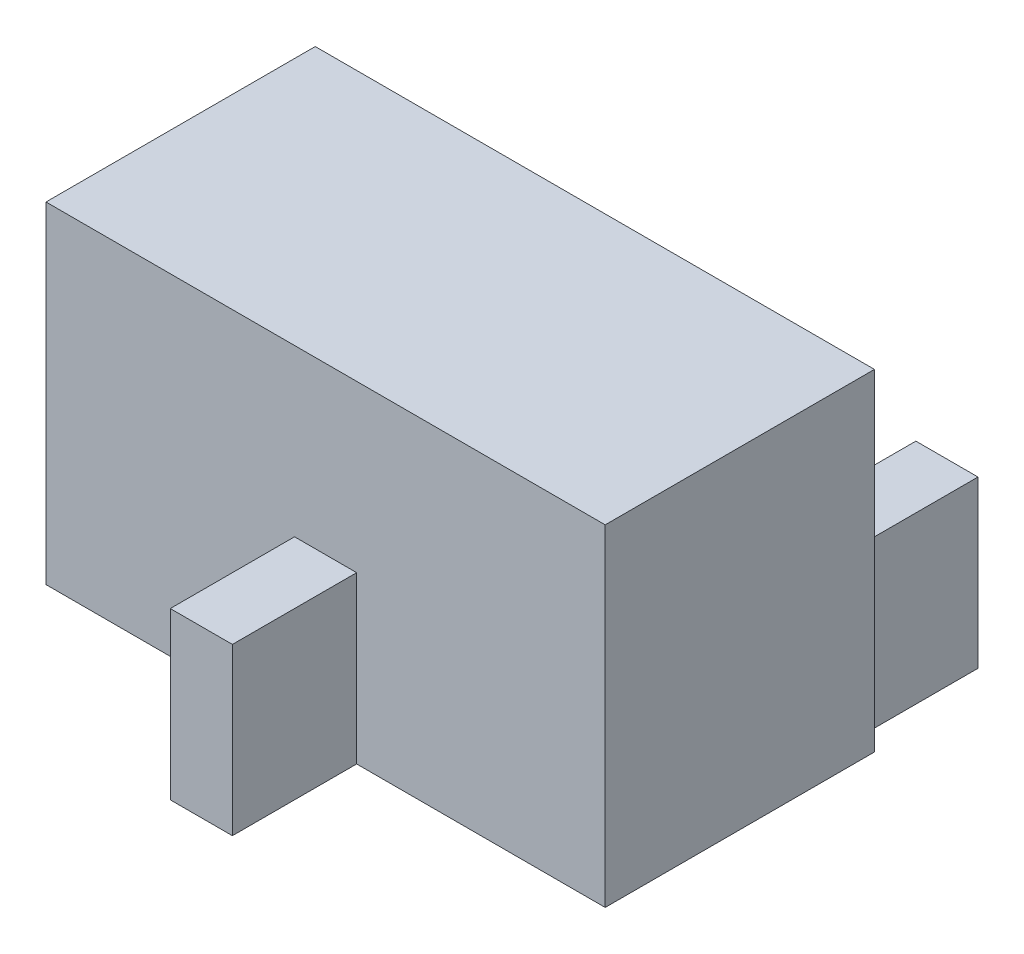
ISO-10303-21;
HEADER;
FILE_DESCRIPTION(('STEP AP214'),'2;1');
FILE_NAME('part.step','',(''),(''),'','','');
FILE_SCHEMA(('AUTOMOTIVE_DESIGN { 1 0 10303 214 1 1 1 1 }'));
ENDSEC;
DATA;
#1=APPLICATION_CONTEXT('core data for automotive mechanical design processes');
#2=APPLICATION_PROTOCOL_DEFINITION('international standard','automotive_design',2000,#1);
#3=PRODUCT_CONTEXT('',#1,'mechanical');
#4=PRODUCT('Part','Part','',(#3));
#5=PRODUCT_RELATED_PRODUCT_CATEGORY('part','',(#4));
#6=PRODUCT_DEFINITION_FORMATION('','',#4);
#7=PRODUCT_DEFINITION_CONTEXT('part definition',#1,'design');
#8=PRODUCT_DEFINITION('design','',#6,#7);
#9=PRODUCT_DEFINITION_SHAPE('','',#8);
#10=(LENGTH_UNIT() NAMED_UNIT(*) SI_UNIT(.MILLI.,.METRE.));
#11=(NAMED_UNIT(*) PLANE_ANGLE_UNIT() SI_UNIT($,.RADIAN.));
#12=(NAMED_UNIT(*) SI_UNIT($,.STERADIAN.) SOLID_ANGLE_UNIT());
#13=UNCERTAINTY_MEASURE_WITH_UNIT(LENGTH_MEASURE(1.E-05),#10,'distance_accuracy_value','');
#14=(GEOMETRIC_REPRESENTATION_CONTEXT(3) GLOBAL_UNCERTAINTY_ASSIGNED_CONTEXT((#13)) GLOBAL_UNIT_ASSIGNED_CONTEXT((#10,
#11,#12)) REPRESENTATION_CONTEXT('',''));
#15=CARTESIAN_POINT('',(0.,0.,0.));
#16=DIRECTION('',(0.,0.,1.));
#17=DIRECTION('',(1.,0.,0.));
#18=AXIS2_PLACEMENT_3D('',#15,#16,#17);
#19=CARTESIAN_POINT('',(-1.81283783783784,1.6,0.816891891891892));
#20=DIRECTION('',(0.,0.,-1.));
#21=DIRECTION('',(-1.,0.,0.));
#22=AXIS2_PLACEMENT_3D('',#19,#20,#21);
#23=PLANE('',#22);
#24=DIRECTION('',(0.,-1.,0.));
#25=VECTOR('',#24,1.);
#26=CARTESIAN_POINT('',(-0.612837837837838,0.8,0.816891891891892));
#27=LINE('',#26,#25);
#28=CARTESIAN_POINT('',(-0.612837837837838,0.8,0.816891891891892));
#29=VERTEX_POINT('',#28);
#30=CARTESIAN_POINT('',(-0.612837837837838,0.,0.816891891891892));
#31=VERTEX_POINT('',#30);
#32=EDGE_CURVE('E314',#29,#31,#27,.T.);
#33=ORIENTED_EDGE('',*,*,#32,.F.);
#34=DIRECTION('',(-1.,0.,0.));
#35=VECTOR('',#34,1.);
#36=CARTESIAN_POINT('',(-0.312837837837838,0.8,0.816891891891892));
#37=LINE('',#36,#35);
#38=CARTESIAN_POINT('',(-0.312837837837838,0.8,0.816891891891892));
#39=VERTEX_POINT('',#38);
#40=EDGE_CURVE('E168',#39,#29,#37,.T.);
#41=ORIENTED_EDGE('',*,*,#40,.F.);
#42=DIRECTION('',(0.,-1.,0.));
#43=VECTOR('',#42,1.);
#44=CARTESIAN_POINT('',(-0.312837837837838,0.8,0.816891891891892));
#45=LINE('',#44,#43);
#46=CARTESIAN_POINT('',(-0.312837837837838,0.,0.816891891891892));
#47=VERTEX_POINT('',#46);
#48=EDGE_CURVE('E180',#39,#47,#45,.T.);
#49=ORIENTED_EDGE('',*,*,#48,.T.);
#50=DIRECTION('',(1.,0.,0.));
#51=VECTOR('',#50,1.);
#52=CARTESIAN_POINT('',(-1.81283783783784,0.,0.816891891891892));
#53=LINE('',#52,#51);
#54=CARTESIAN_POINT('',(0.887162162162162,0.,0.816891891891892));
#55=VERTEX_POINT('',#54);
#56=EDGE_CURVE('E247',#47,#55,#53,.T.);
#57=ORIENTED_EDGE('',*,*,#56,.T.);
#58=DIRECTION('',(0.,-1.,0.));
#59=VECTOR('',#58,1.);
#60=CARTESIAN_POINT('',(0.887162162162162,1.6,0.816891891891892));
#61=LINE('',#60,#59);
#62=CARTESIAN_POINT('',(0.887162162162162,1.6,0.816891891891892));
#63=VERTEX_POINT('',#62);
#64=EDGE_CURVE('E45',#63,#55,#61,.T.);
#65=ORIENTED_EDGE('',*,*,#64,.F.);
#66=DIRECTION('',(1.,0.,0.));
#67=VECTOR('',#66,1.);
#68=CARTESIAN_POINT('',(-1.81283783783784,1.6,0.816891891891892));
#69=LINE('',#68,#67);
#70=CARTESIAN_POINT('',(-1.81283783783784,1.6,0.816891891891892));
#71=VERTEX_POINT('',#70);
#72=EDGE_CURVE('E237',#71,#63,#69,.T.);
#73=ORIENTED_EDGE('',*,*,#72,.F.);
#74=DIRECTION('',(0.,-1.,0.));
#75=VECTOR('',#74,1.);
#76=CARTESIAN_POINT('',(-1.81283783783784,1.6,0.816891891891892));
#77=LINE('',#76,#75);
#78=CARTESIAN_POINT('',(-1.81283783783784,0.,0.816891891891892));
#79=VERTEX_POINT('',#78);
#80=EDGE_CURVE('E11',#71,#79,#77,.T.);
#81=ORIENTED_EDGE('',*,*,#80,.T.);
#82=EDGE_CURVE('E248',#79,#31,#53,.T.);
#83=ORIENTED_EDGE('',*,*,#82,.T.);
#84=EDGE_LOOP('',(#33,#41,#49,#57,#65,#73,#81,#83));
#85=FACE_BOUND('',#84,.T.);
#86=ADVANCED_FACE('F37',(#85),#23,.F.);
#87=CARTESIAN_POINT('',(-1.81283783783784,1.6,-0.483108108108108));
#88=DIRECTION('',(0.,0.,1.));
#89=DIRECTION('',(1.,0.,0.));
#90=AXIS2_PLACEMENT_3D('',#87,#88,#89);
#91=PLANE('',#90);
#92=DIRECTION('',(0.,-1.,0.));
#93=VECTOR('',#92,1.);
#94=CARTESIAN_POINT('',(0.787162162162162,0.8,-0.483108108108108));
#95=LINE('',#94,#93);
#96=CARTESIAN_POINT('',(0.787162162162162,0.8,-0.483108108108108));
#97=VERTEX_POINT('',#96);
#98=CARTESIAN_POINT('',(0.787162162162161,0.,-0.483108108108108));
#99=VERTEX_POINT('',#98);
#100=EDGE_CURVE('E192',#97,#99,#95,.T.);
#101=ORIENTED_EDGE('',*,*,#100,.F.);
#102=DIRECTION('',(1.,0.,0.));
#103=VECTOR('',#102,1.);
#104=CARTESIAN_POINT('',(0.787162162162162,0.8,-0.483108108108108));
#105=LINE('',#104,#103);
#106=CARTESIAN_POINT('',(0.487162162162162,0.8,-0.483108108108108));
#107=VERTEX_POINT('',#106);
#108=EDGE_CURVE('E60',#107,#97,#105,.T.);
#109=ORIENTED_EDGE('',*,*,#108,.F.);
#110=DIRECTION('',(0.,-1.,0.));
#111=VECTOR('',#110,1.);
#112=CARTESIAN_POINT('',(0.487162162162162,0.8,-0.483108108108108));
#113=LINE('',#112,#111);
#114=CARTESIAN_POINT('',(0.487162162162162,0.,-0.483108108108108));
#115=VERTEX_POINT('',#114);
#116=EDGE_CURVE('E199',#107,#115,#113,.T.);
#117=ORIENTED_EDGE('',*,*,#116,.T.);
#118=DIRECTION('',(-1.,0.,0.));
#119=VECTOR('',#118,1.);
#120=CARTESIAN_POINT('',(-1.81283783783784,0.,-0.483108108108108));
#121=LINE('',#120,#119);
#122=CARTESIAN_POINT('',(-1.41283783783784,0.,-0.483108108108108));
#123=VERTEX_POINT('',#122);
#124=EDGE_CURVE('E255',#115,#123,#121,.T.);
#125=ORIENTED_EDGE('',*,*,#124,.T.);
#126=DIRECTION('',(0.,-1.,0.));
#127=VECTOR('',#126,1.);
#128=CARTESIAN_POINT('',(-1.41283783783784,0.8,-0.483108108108108));
#129=LINE('',#128,#127);
#130=CARTESIAN_POINT('',(-1.41283783783784,0.8,-0.483108108108108));
#131=VERTEX_POINT('',#130);
#132=EDGE_CURVE('E227',#131,#123,#129,.T.);
#133=ORIENTED_EDGE('',*,*,#132,.F.);
#134=DIRECTION('',(1.,0.,0.));
#135=VECTOR('',#134,1.);
#136=CARTESIAN_POINT('',(-1.71283783783784,0.8,-0.483108108108108));
#137=LINE('',#136,#135);
#138=CARTESIAN_POINT('',(-1.71283783783784,0.8,-0.483108108108108));
#139=VERTEX_POINT('',#138);
#140=EDGE_CURVE('E210',#139,#131,#137,.T.);
#141=ORIENTED_EDGE('',*,*,#140,.F.);
#142=DIRECTION('',(0.,-1.,0.));
#143=VECTOR('',#142,1.);
#144=CARTESIAN_POINT('',(-1.71283783783784,0.8,-0.483108108108108));
#145=LINE('',#144,#143);
#146=CARTESIAN_POINT('',(-1.71283783783784,0.,-0.483108108108108));
#147=VERTEX_POINT('',#146);
#148=EDGE_CURVE('E230',#139,#147,#145,.T.);
#149=ORIENTED_EDGE('',*,*,#148,.T.);
#150=CARTESIAN_POINT('',(-1.81283783783784,0.,-0.483108108108108));
#151=VERTEX_POINT('',#150);
#152=EDGE_CURVE('E253',#147,#151,#121,.T.);
#153=ORIENTED_EDGE('',*,*,#152,.T.);
#154=DIRECTION('',(0.,-1.,0.));
#155=VECTOR('',#154,1.);
#156=CARTESIAN_POINT('',(-1.81283783783784,1.6,-0.483108108108108));
#157=LINE('',#156,#155);
#158=CARTESIAN_POINT('',(-1.81283783783784,1.6,-0.483108108108108));
#159=VERTEX_POINT('',#158);
#160=EDGE_CURVE('E244',#159,#151,#157,.T.);
#161=ORIENTED_EDGE('',*,*,#160,.F.);
#162=DIRECTION('',(-1.,0.,0.));
#163=VECTOR('',#162,1.);
#164=CARTESIAN_POINT('',(-1.81283783783784,1.6,-0.483108108108108));
#165=LINE('',#164,#163);
#166=CARTESIAN_POINT('',(0.887162162162162,1.6,-0.483108108108108));
#167=VERTEX_POINT('',#166);
#168=EDGE_CURVE('E242',#167,#159,#165,.T.);
#169=ORIENTED_EDGE('',*,*,#168,.F.);
#170=DIRECTION('',(0.,-1.,0.));
#171=VECTOR('',#170,1.);
#172=CARTESIAN_POINT('',(0.887162162162162,1.6,-0.483108108108108));
#173=LINE('',#172,#171);
#174=CARTESIAN_POINT('',(0.887162162162162,0.,-0.483108108108108));
#175=VERTEX_POINT('',#174);
#176=EDGE_CURVE('E258',#167,#175,#173,.T.);
#177=ORIENTED_EDGE('',*,*,#176,.T.);
#178=EDGE_CURVE('E238',#175,#99,#121,.T.);
#179=ORIENTED_EDGE('',*,*,#178,.T.);
#180=EDGE_LOOP('',(#101,#109,#117,#125,#133,#141,#149,#153,#161,#169,#177,#179));
#181=FACE_BOUND('',#180,.T.);
#182=ADVANCED_FACE('F274',(#181),#91,.F.);
#183=CARTESIAN_POINT('',(-1.81283783783784,1.6,-0.483108108108108));
#184=DIRECTION('',(1.,0.,0.));
#185=DIRECTION('',(0.,0.,-1.));
#186=AXIS2_PLACEMENT_3D('',#183,#184,#185);
#187=PLANE('',#186);
#188=DIRECTION('',(0.,0.,1.));
#189=VECTOR('',#188,1.);
#190=CARTESIAN_POINT('',(-1.81283783783784,0.,-0.483108108108108));
#191=LINE('',#190,#189);
#192=EDGE_CURVE('E233',#151,#79,#191,.T.);
#193=ORIENTED_EDGE('',*,*,#192,.T.);
#194=ORIENTED_EDGE('',*,*,#80,.F.);
#195=DIRECTION('',(0.,0.,1.));
#196=VECTOR('',#195,1.);
#197=CARTESIAN_POINT('',(-1.81283783783784,1.6,-0.483108108108108));
#198=LINE('',#197,#196);
#199=EDGE_CURVE('E234',#159,#71,#198,.T.);
#200=ORIENTED_EDGE('',*,*,#199,.F.);
#201=ORIENTED_EDGE('',*,*,#160,.T.);
#202=EDGE_LOOP('',(#193,#194,#200,#201));
#203=FACE_BOUND('',#202,.T.);
#204=ADVANCED_FACE('F39',(#203),#187,.F.);
#205=CARTESIAN_POINT('',(0.887162162162162,1.6,-0.483108108108108));
#206=DIRECTION('',(-1.,0.,0.));
#207=DIRECTION('',(0.,0.,1.));
#208=AXIS2_PLACEMENT_3D('',#205,#206,#207);
#209=PLANE('',#208);
#210=DIRECTION('',(0.,0.,-1.));
#211=VECTOR('',#210,1.);
#212=CARTESIAN_POINT('',(0.887162162162162,0.,-0.483108108108108));
#213=LINE('',#212,#211);
#214=EDGE_CURVE('E251',#55,#175,#213,.T.);
#215=ORIENTED_EDGE('',*,*,#214,.T.);
#216=ORIENTED_EDGE('',*,*,#176,.F.);
#217=DIRECTION('',(0.,0.,-1.));
#218=VECTOR('',#217,1.);
#219=CARTESIAN_POINT('',(0.887162162162162,1.6,-0.483108108108108));
#220=LINE('',#219,#218);
#221=EDGE_CURVE('E240',#63,#167,#220,.T.);
#222=ORIENTED_EDGE('',*,*,#221,.F.);
#223=ORIENTED_EDGE('',*,*,#64,.T.);
#224=EDGE_LOOP('',(#215,#216,#222,#223));
#225=FACE_BOUND('',#224,.T.);
#226=ADVANCED_FACE('F265',(#225),#209,.F.);
#227=CARTESIAN_POINT('',(0.,1.6,0.));
#228=DIRECTION('',(0.,1.,0.));
#229=DIRECTION('',(0.,0.,1.));
#230=AXIS2_PLACEMENT_3D('',#227,#228,#229);
#231=PLANE('',#230);
#232=ORIENTED_EDGE('',*,*,#199,.T.);
#233=ORIENTED_EDGE('',*,*,#72,.T.);
#234=ORIENTED_EDGE('',*,*,#221,.T.);
#235=ORIENTED_EDGE('',*,*,#168,.T.);
#236=EDGE_LOOP('',(#232,#233,#234,#235));
#237=FACE_BOUND('',#236,.T.);
#238=ADVANCED_FACE('F313',(#237),#231,.T.);
#239=CARTESIAN_POINT('',(0.,0.,0.));
#240=DIRECTION('',(0.,1.,0.));
#241=DIRECTION('',(0.,0.,1.));
#242=AXIS2_PLACEMENT_3D('',#239,#240,#241);
#243=PLANE('',#242);
#244=ORIENTED_EDGE('',*,*,#192,.F.);
#245=ORIENTED_EDGE('',*,*,#152,.F.);
#246=DIRECTION('',(0.,0.,1.));
#247=VECTOR('',#246,1.);
#248=CARTESIAN_POINT('',(-1.71283783783784,0.,-0.483108108108108));
#249=LINE('',#248,#247);
#250=CARTESIAN_POINT('',(-1.71283783783784,0.,-1.08310810810811));
#251=VERTEX_POINT('',#250);
#252=EDGE_CURVE('E207',#251,#147,#249,.T.);
#253=ORIENTED_EDGE('',*,*,#252,.F.);
#254=DIRECTION('',(-1.,0.,0.));
#255=VECTOR('',#254,1.);
#256=CARTESIAN_POINT('',(-1.71283783783784,0.,-1.08310810810811));
#257=LINE('',#256,#255);
#258=CARTESIAN_POINT('',(-1.41283783783784,0.,-1.08310810810811));
#259=VERTEX_POINT('',#258);
#260=EDGE_CURVE('E211',#259,#251,#257,.T.);
#261=ORIENTED_EDGE('',*,*,#260,.F.);
#262=DIRECTION('',(0.,0.,-1.));
#263=VECTOR('',#262,1.);
#264=CARTESIAN_POINT('',(-1.41283783783784,0.,-0.483108108108108));
#265=LINE('',#264,#263);
#266=EDGE_CURVE('E219',#123,#259,#265,.T.);
#267=ORIENTED_EDGE('',*,*,#266,.F.);
#268=ORIENTED_EDGE('',*,*,#124,.F.);
#269=DIRECTION('',(0.,0.,1.));
#270=VECTOR('',#269,1.);
#271=CARTESIAN_POINT('',(0.487162162162162,0.,-0.483108108108108));
#272=LINE('',#271,#270);
#273=CARTESIAN_POINT('',(0.487162162162162,0.,-1.08310810810811));
#274=VERTEX_POINT('',#273);
#275=EDGE_CURVE('E188',#274,#115,#272,.T.);
#276=ORIENTED_EDGE('',*,*,#275,.F.);
#277=DIRECTION('',(-1.,0.,0.));
#278=VECTOR('',#277,1.);
#279=CARTESIAN_POINT('',(0.787162162162162,0.,-1.08310810810811));
#280=LINE('',#279,#278);
#281=CARTESIAN_POINT('',(0.787162162162162,0.,-1.08310810810811));
#282=VERTEX_POINT('',#281);
#283=EDGE_CURVE('E178',#282,#274,#280,.T.);
#284=ORIENTED_EDGE('',*,*,#283,.F.);
#285=DIRECTION('',(0.,0.,-1.));
#286=VECTOR('',#285,1.);
#287=CARTESIAN_POINT('',(0.787162162162162,0.,-0.483108108108108));
#288=LINE('',#287,#286);
#289=EDGE_CURVE('E175',#99,#282,#288,.T.);
#290=ORIENTED_EDGE('',*,*,#289,.F.);
#291=ORIENTED_EDGE('',*,*,#178,.F.);
#292=ORIENTED_EDGE('',*,*,#214,.F.);
#293=ORIENTED_EDGE('',*,*,#56,.F.);
#294=DIRECTION('',(0.,0.,-1.));
#295=VECTOR('',#294,1.);
#296=CARTESIAN_POINT('',(-0.312837837837838,0.,1.41689189189189));
#297=LINE('',#296,#295);
#298=CARTESIAN_POINT('',(-0.312837837837838,0.,1.41689189189189));
#299=VERTEX_POINT('',#298);
#300=EDGE_CURVE('E52',#299,#47,#297,.T.);
#301=ORIENTED_EDGE('',*,*,#300,.F.);
#302=DIRECTION('',(1.,0.,0.));
#303=VECTOR('',#302,1.);
#304=CARTESIAN_POINT('',(-0.312837837837838,0.,1.41689189189189));
#305=LINE('',#304,#303);
#306=CARTESIAN_POINT('',(-0.612837837837838,0.,1.41689189189189));
#307=VERTEX_POINT('',#306);
#308=EDGE_CURVE('E319',#307,#299,#305,.T.);
#309=ORIENTED_EDGE('',*,*,#308,.F.);
#310=DIRECTION('',(0.,0.,1.));
#311=VECTOR('',#310,1.);
#312=CARTESIAN_POINT('',(-0.612837837837838,0.,1.41689189189189));
#313=LINE('',#312,#311);
#314=EDGE_CURVE('E174',#31,#307,#313,.T.);
#315=ORIENTED_EDGE('',*,*,#314,.F.);
#316=ORIENTED_EDGE('',*,*,#82,.F.);
#317=EDGE_LOOP('',(#244,#245,#253,#261,#267,#268,#276,#284,#290,#291,#292,#293,#301,#309,#315,#316));
#318=FACE_BOUND('',#317,.T.);
#319=ADVANCED_FACE('F272',(#318),#243,.F.);
#320=CARTESIAN_POINT('',(-1.71283783783784,0.8,-0.483108108108108));
#321=DIRECTION('',(1.,0.,0.));
#322=DIRECTION('',(0.,0.,-1.));
#323=AXIS2_PLACEMENT_3D('',#320,#321,#322);
#324=PLANE('',#323);
#325=ORIENTED_EDGE('',*,*,#252,.T.);
#326=ORIENTED_EDGE('',*,*,#148,.F.);
#327=DIRECTION('',(0.,0.,1.));
#328=VECTOR('',#327,1.);
#329=CARTESIAN_POINT('',(-1.71283783783784,0.8,-0.483108108108108));
#330=LINE('',#329,#328);
#331=CARTESIAN_POINT('',(-1.71283783783784,0.8,-1.08310810810811));
#332=VERTEX_POINT('',#331);
#333=EDGE_CURVE('E208',#332,#139,#330,.T.);
#334=ORIENTED_EDGE('',*,*,#333,.F.);
#335=DIRECTION('',(0.,-1.,0.));
#336=VECTOR('',#335,1.);
#337=CARTESIAN_POINT('',(-1.71283783783784,0.8,-1.08310810810811));
#338=LINE('',#337,#336);
#339=EDGE_CURVE('E217',#332,#251,#338,.T.);
#340=ORIENTED_EDGE('',*,*,#339,.T.);
#341=EDGE_LOOP('',(#325,#326,#334,#340));
#342=FACE_BOUND('',#341,.T.);
#343=ADVANCED_FACE('F304',(#342),#324,.F.);
#344=CARTESIAN_POINT('',(-1.41283783783784,0.8,-0.483108108108108));
#345=DIRECTION('',(-1.,0.,0.));
#346=DIRECTION('',(0.,0.,1.));
#347=AXIS2_PLACEMENT_3D('',#344,#345,#346);
#348=PLANE('',#347);
#349=ORIENTED_EDGE('',*,*,#266,.T.);
#350=DIRECTION('',(0.,-1.,0.));
#351=VECTOR('',#350,1.);
#352=CARTESIAN_POINT('',(-1.41283783783784,0.8,-1.08310810810811));
#353=LINE('',#352,#351);
#354=CARTESIAN_POINT('',(-1.41283783783784,0.8,-1.08310810810811));
#355=VERTEX_POINT('',#354);
#356=EDGE_CURVE('E224',#355,#259,#353,.T.);
#357=ORIENTED_EDGE('',*,*,#356,.F.);
#358=DIRECTION('',(0.,0.,-1.));
#359=VECTOR('',#358,1.);
#360=CARTESIAN_POINT('',(-1.41283783783784,0.8,-0.483108108108108));
#361=LINE('',#360,#359);
#362=EDGE_CURVE('E213',#131,#355,#361,.T.);
#363=ORIENTED_EDGE('',*,*,#362,.F.);
#364=ORIENTED_EDGE('',*,*,#132,.T.);
#365=EDGE_LOOP('',(#349,#357,#363,#364));
#366=FACE_BOUND('',#365,.T.);
#367=ADVANCED_FACE('F293',(#366),#348,.F.);
#368=CARTESIAN_POINT('',(-1.71283783783784,0.8,-1.08310810810811));
#369=DIRECTION('',(0.,0.,1.));
#370=DIRECTION('',(1.,0.,0.));
#371=AXIS2_PLACEMENT_3D('',#368,#369,#370);
#372=PLANE('',#371);
#373=ORIENTED_EDGE('',*,*,#260,.T.);
#374=ORIENTED_EDGE('',*,*,#339,.F.);
#375=DIRECTION('',(-1.,0.,0.));
#376=VECTOR('',#375,1.);
#377=CARTESIAN_POINT('',(-1.71283783783784,0.8,-1.08310810810811));
#378=LINE('',#377,#376);
#379=EDGE_CURVE('E215',#355,#332,#378,.T.);
#380=ORIENTED_EDGE('',*,*,#379,.F.);
#381=ORIENTED_EDGE('',*,*,#356,.T.);
#382=EDGE_LOOP('',(#373,#374,#380,#381));
#383=FACE_BOUND('',#382,.T.);
#384=ADVANCED_FACE('F300',(#383),#372,.F.);
#385=CARTESIAN_POINT('',(0.,0.8,0.));
#386=DIRECTION('',(0.,-1.,0.));
#387=DIRECTION('',(0.,0.,-1.));
#388=AXIS2_PLACEMENT_3D('',#385,#386,#387);
#389=PLANE('',#388);
#390=ORIENTED_EDGE('',*,*,#333,.T.);
#391=ORIENTED_EDGE('',*,*,#140,.T.);
#392=ORIENTED_EDGE('',*,*,#362,.T.);
#393=ORIENTED_EDGE('',*,*,#379,.T.);
#394=EDGE_LOOP('',(#390,#391,#392,#393));
#395=FACE_BOUND('',#394,.T.);
#396=ADVANCED_FACE('F307',(#395),#389,.F.);
#397=CARTESIAN_POINT('',(0.787162162162162,0.8,-0.483108108108108));
#398=DIRECTION('',(-1.,0.,0.));
#399=DIRECTION('',(0.,0.,1.));
#400=AXIS2_PLACEMENT_3D('',#397,#398,#399);
#401=PLANE('',#400);
#402=ORIENTED_EDGE('',*,*,#289,.T.);
#403=DIRECTION('',(0.,-1.,0.));
#404=VECTOR('',#403,1.);
#405=CARTESIAN_POINT('',(0.787162162162162,0.8,-1.08310810810811));
#406=LINE('',#405,#404);
#407=CARTESIAN_POINT('',(0.787162162162162,0.8,-1.08310810810811));
#408=VERTEX_POINT('',#407);
#409=EDGE_CURVE('E204',#408,#282,#406,.T.);
#410=ORIENTED_EDGE('',*,*,#409,.F.);
#411=DIRECTION('',(0.,0.,-1.));
#412=VECTOR('',#411,1.);
#413=CARTESIAN_POINT('',(0.787162162162162,0.8,-0.483108108108108));
#414=LINE('',#413,#412);
#415=EDGE_CURVE('E184',#97,#408,#414,.T.);
#416=ORIENTED_EDGE('',*,*,#415,.F.);
#417=ORIENTED_EDGE('',*,*,#100,.T.);
#418=EDGE_LOOP('',(#402,#410,#416,#417));
#419=FACE_BOUND('',#418,.T.);
#420=ADVANCED_FACE('F278',(#419),#401,.F.);
#421=CARTESIAN_POINT('',(0.787162162162162,0.8,-1.08310810810811));
#422=DIRECTION('',(0.,0.,1.));
#423=DIRECTION('',(1.,0.,0.));
#424=AXIS2_PLACEMENT_3D('',#421,#422,#423);
#425=PLANE('',#424);
#426=ORIENTED_EDGE('',*,*,#283,.T.);
#427=DIRECTION('',(0.,-1.,0.));
#428=VECTOR('',#427,1.);
#429=CARTESIAN_POINT('',(0.487162162162162,0.8,-1.08310810810811));
#430=LINE('',#429,#428);
#431=CARTESIAN_POINT('',(0.487162162162162,0.8,-1.08310810810811));
#432=VERTEX_POINT('',#431);
#433=EDGE_CURVE('E201',#432,#274,#430,.T.);
#434=ORIENTED_EDGE('',*,*,#433,.F.);
#435=DIRECTION('',(-1.,0.,0.));
#436=VECTOR('',#435,1.);
#437=CARTESIAN_POINT('',(0.787162162162162,0.8,-1.08310810810811));
#438=LINE('',#437,#436);
#439=EDGE_CURVE('E187',#408,#432,#438,.T.);
#440=ORIENTED_EDGE('',*,*,#439,.F.);
#441=ORIENTED_EDGE('',*,*,#409,.T.);
#442=EDGE_LOOP('',(#426,#434,#440,#441));
#443=FACE_BOUND('',#442,.T.);
#444=ADVANCED_FACE('F353',(#443),#425,.F.);
#445=CARTESIAN_POINT('',(0.487162162162162,0.8,-0.483108108108108));
#446=DIRECTION('',(1.,0.,0.));
#447=DIRECTION('',(0.,0.,-1.));
#448=AXIS2_PLACEMENT_3D('',#445,#446,#447);
#449=PLANE('',#448);
#450=ORIENTED_EDGE('',*,*,#275,.T.);
#451=ORIENTED_EDGE('',*,*,#116,.F.);
#452=DIRECTION('',(0.,0.,1.));
#453=VECTOR('',#452,1.);
#454=CARTESIAN_POINT('',(0.487162162162162,0.8,-0.483108108108108));
#455=LINE('',#454,#453);
#456=EDGE_CURVE('E190',#432,#107,#455,.T.);
#457=ORIENTED_EDGE('',*,*,#456,.F.);
#458=ORIENTED_EDGE('',*,*,#433,.T.);
#459=EDGE_LOOP('',(#450,#451,#457,#458));
#460=FACE_BOUND('',#459,.T.);
#461=ADVANCED_FACE('F286',(#460),#449,.F.);
#462=CARTESIAN_POINT('',(0.,0.8,0.));
#463=DIRECTION('',(0.,1.,0.));
#464=DIRECTION('',(0.,0.,1.));
#465=AXIS2_PLACEMENT_3D('',#462,#463,#464);
#466=PLANE('',#465);
#467=ORIENTED_EDGE('',*,*,#415,.T.);
#468=ORIENTED_EDGE('',*,*,#439,.T.);
#469=ORIENTED_EDGE('',*,*,#456,.T.);
#470=ORIENTED_EDGE('',*,*,#108,.T.);
#471=EDGE_LOOP('',(#467,#468,#469,#470));
#472=FACE_BOUND('',#471,.T.);
#473=ADVANCED_FACE('F281',(#472),#466,.T.);
#474=CARTESIAN_POINT('',(-0.612837837837838,0.8,1.41689189189189));
#475=DIRECTION('',(1.,0.,0.));
#476=DIRECTION('',(0.,0.,-1.));
#477=AXIS2_PLACEMENT_3D('',#474,#475,#476);
#478=PLANE('',#477);
#479=ORIENTED_EDGE('',*,*,#314,.T.);
#480=DIRECTION('',(0.,-1.,0.));
#481=VECTOR('',#480,1.);
#482=CARTESIAN_POINT('',(-0.612837837837838,0.8,1.41689189189189));
#483=LINE('',#482,#481);
#484=CARTESIAN_POINT('',(-0.612837837837838,0.8,1.41689189189189));
#485=VERTEX_POINT('',#484);
#486=EDGE_CURVE('E157',#485,#307,#483,.T.);
#487=ORIENTED_EDGE('',*,*,#486,.F.);
#488=DIRECTION('',(0.,0.,1.));
#489=VECTOR('',#488,1.);
#490=CARTESIAN_POINT('',(-0.612837837837838,0.8,1.41689189189189));
#491=LINE('',#490,#489);
#492=EDGE_CURVE('E163',#29,#485,#491,.T.);
#493=ORIENTED_EDGE('',*,*,#492,.F.);
#494=ORIENTED_EDGE('',*,*,#32,.T.);
#495=EDGE_LOOP('',(#479,#487,#493,#494));
#496=FACE_BOUND('',#495,.T.);
#497=ADVANCED_FACE('F172',(#496),#478,.F.);
#498=CARTESIAN_POINT('',(-0.312837837837838,0.8,1.41689189189189));
#499=DIRECTION('',(0.,0.,-1.));
#500=DIRECTION('',(-1.,0.,0.));
#501=AXIS2_PLACEMENT_3D('',#498,#499,#500);
#502=PLANE('',#501);
#503=ORIENTED_EDGE('',*,*,#308,.T.);
#504=DIRECTION('',(0.,-1.,0.));
#505=VECTOR('',#504,1.);
#506=CARTESIAN_POINT('',(-0.312837837837838,0.8,1.41689189189189));
#507=LINE('',#506,#505);
#508=CARTESIAN_POINT('',(-0.312837837837838,0.8,1.41689189189189));
#509=VERTEX_POINT('',#508);
#510=EDGE_CURVE('E159',#509,#299,#507,.T.);
#511=ORIENTED_EDGE('',*,*,#510,.F.);
#512=DIRECTION('',(1.,0.,0.));
#513=VECTOR('',#512,1.);
#514=CARTESIAN_POINT('',(-0.312837837837838,0.8,1.41689189189189));
#515=LINE('',#514,#513);
#516=EDGE_CURVE('E153',#485,#509,#515,.T.);
#517=ORIENTED_EDGE('',*,*,#516,.F.);
#518=ORIENTED_EDGE('',*,*,#486,.T.);
#519=EDGE_LOOP('',(#503,#511,#517,#518));
#520=FACE_BOUND('',#519,.T.);
#521=ADVANCED_FACE('F155',(#520),#502,.F.);
#522=CARTESIAN_POINT('',(-0.312837837837838,0.8,1.41689189189189));
#523=DIRECTION('',(-1.,0.,0.));
#524=DIRECTION('',(0.,0.,1.));
#525=AXIS2_PLACEMENT_3D('',#522,#523,#524);
#526=PLANE('',#525);
#527=ORIENTED_EDGE('',*,*,#300,.T.);
#528=ORIENTED_EDGE('',*,*,#48,.F.);
#529=DIRECTION('',(0.,0.,-1.));
#530=VECTOR('',#529,1.);
#531=CARTESIAN_POINT('',(-0.312837837837838,0.8,1.41689189189189));
#532=LINE('',#531,#530);
#533=EDGE_CURVE('E162',#509,#39,#532,.T.);
#534=ORIENTED_EDGE('',*,*,#533,.F.);
#535=ORIENTED_EDGE('',*,*,#510,.T.);
#536=EDGE_LOOP('',(#527,#528,#534,#535));
#537=FACE_BOUND('',#536,.T.);
#538=ADVANCED_FACE('F322',(#537),#526,.F.);
#539=CARTESIAN_POINT('',(0.,0.8,0.));
#540=DIRECTION('',(0.,1.,0.));
#541=DIRECTION('',(0.,0.,1.));
#542=AXIS2_PLACEMENT_3D('',#539,#540,#541);
#543=PLANE('',#542);
#544=ORIENTED_EDGE('',*,*,#492,.T.);
#545=ORIENTED_EDGE('',*,*,#516,.T.);
#546=ORIENTED_EDGE('',*,*,#533,.T.);
#547=ORIENTED_EDGE('',*,*,#40,.T.);
#548=EDGE_LOOP('',(#544,#545,#546,#547));
#549=FACE_BOUND('',#548,.T.);
#550=ADVANCED_FACE('F166',(#549),#543,.T.);
#551=CLOSED_SHELL('',(#86,#182,#204,#226,#238,#319,#343,#367,#384,#396,#420,#444,#461,#473,#497,
#521,#538,#550));
#552=MANIFOLD_SOLID_BREP('B2',#551);
#553=ADVANCED_BREP_SHAPE_REPRESENTATION('',(#18,#552),#14);
#554=SHAPE_DEFINITION_REPRESENTATION(#9,#553);
ENDSEC;
END-ISO-10303-21;
